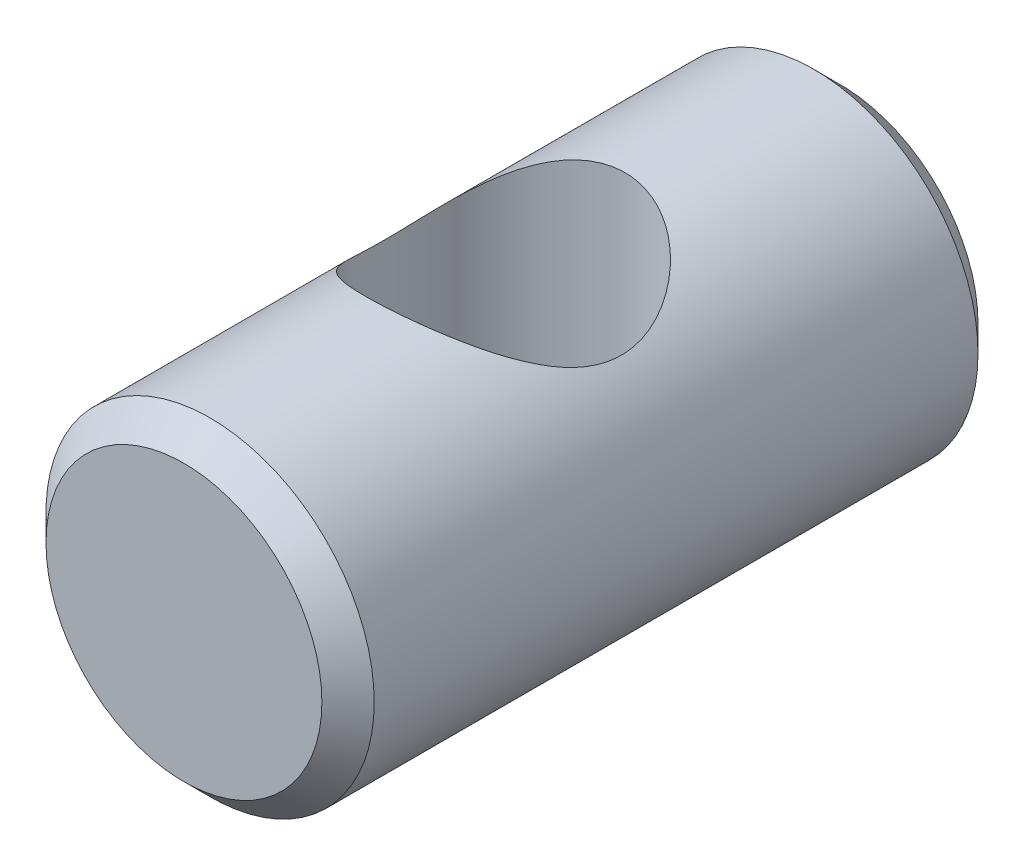
ISO-10303-21;
HEADER;
FILE_DESCRIPTION(('STEP AP214'),'2;1');
FILE_NAME('part.step','',(''),(''),'','','');
FILE_SCHEMA(('AUTOMOTIVE_DESIGN { 1 0 10303 214 1 1 1 1 }'));
ENDSEC;
DATA;
#1=APPLICATION_CONTEXT('core data for automotive mechanical design processes');
#2=APPLICATION_PROTOCOL_DEFINITION('international standard','automotive_design',2000,#1);
#3=PRODUCT_CONTEXT('',#1,'mechanical');
#4=PRODUCT('Part','Part','',(#3));
#5=PRODUCT_RELATED_PRODUCT_CATEGORY('part','',(#4));
#6=PRODUCT_DEFINITION_FORMATION('','',#4);
#7=PRODUCT_DEFINITION_CONTEXT('part definition',#1,'design');
#8=PRODUCT_DEFINITION('design','',#6,#7);
#9=PRODUCT_DEFINITION_SHAPE('','',#8);
#10=(LENGTH_UNIT() NAMED_UNIT(*) SI_UNIT(.MILLI.,.METRE.));
#11=(NAMED_UNIT(*) PLANE_ANGLE_UNIT() SI_UNIT($,.RADIAN.));
#12=(NAMED_UNIT(*) SI_UNIT($,.STERADIAN.) SOLID_ANGLE_UNIT());
#13=UNCERTAINTY_MEASURE_WITH_UNIT(LENGTH_MEASURE(1.E-05),#10,'distance_accuracy_value','');
#14=(GEOMETRIC_REPRESENTATION_CONTEXT(3) GLOBAL_UNCERTAINTY_ASSIGNED_CONTEXT((#13)) GLOBAL_UNIT_ASSIGNED_CONTEXT((#10,
#11,#12)) REPRESENTATION_CONTEXT('',''));
#15=CARTESIAN_POINT('',(0.,0.,0.));
#16=DIRECTION('',(0.,0.,1.));
#17=DIRECTION('',(1.,0.,0.));
#18=AXIS2_PLACEMENT_3D('',#15,#16,#17);
#19=CARTESIAN_POINT('',(0.,0.,9.525));
#20=DIRECTION('',(0.,0.,-1.));
#21=DIRECTION('',(-1.,0.,0.));
#22=AXIS2_PLACEMENT_3D('',#19,#20,#21);
#23=CYLINDRICAL_SURFACE('',#22,4.765);
#24=CARTESIAN_POINT('',(0.,-4.765,-3.42087708051605));
#25=CARTESIAN_POINT('',(-0.0833627581168181,-4.7649997101109,-3.42696899134863));
#26=CARTESIAN_POINT('',(-0.166953392424251,-4.76280757869707,-3.43001003086424));
#27=CARTESIAN_POINT('',(-0.333933182408652,-4.75402028790231,-3.4299899120654));
#28=CARTESIAN_POINT('',(-0.41732223719261,-4.74742325494959,-3.42692615604904));
#29=CARTESIAN_POINT('',(-0.583312250165056,-4.72989865727235,-3.41478160746824));
#30=CARTESIAN_POINT('',(-0.665912068503747,-4.71896558414041,-3.40569315136156));
#31=CARTESIAN_POINT('',(-0.829610597514772,-4.69295834085159,-3.38168739143667));
#32=CARTESIAN_POINT('',(-0.91070865358331,-4.67788240819801,-3.36676760565251));
#33=CARTESIAN_POINT('',(-1.15000632689336,-4.62699847385246,-3.31382161536754));
#34=CARTESIAN_POINT('',(-1.30524951697123,-4.58542013528299,-3.26752778272676));
#35=CARTESIAN_POINT('',(-1.60411463212557,-4.48962808746058,-3.15544383432779));
#36=CARTESIAN_POINT('',(-1.74773682156028,-4.43541466574349,-3.08965416222603));
#37=CARTESIAN_POINT('',(-2.03259497643689,-4.31273538578719,-2.93522566350036));
#38=CARTESIAN_POINT('',(-2.17272279857911,-4.24347672491827,-2.84518090003159));
#39=CARTESIAN_POINT('',(-2.43631552731587,-4.09784606286129,-2.64803347355049));
#40=CARTESIAN_POINT('',(-2.55976291960052,-4.02146672501527,-2.54091313456509));
#41=CARTESIAN_POINT('',(-2.81327393100644,-3.84950291536883,-2.28757037498761));
#42=CARTESIAN_POINT('',(-2.93940806717613,-3.75321839663728,-2.13784494064544));
#43=CARTESIAN_POINT('',(-3.10885207016274,-3.61188607024724,-1.89774924473951));
#44=CARTESIAN_POINT('',(-3.16205944901992,-3.56527135977744,-1.81509327318893));
#45=CARTESIAN_POINT('',(-3.26165283895997,-3.47438917550769,-1.64456461914389));
#46=CARTESIAN_POINT('',(-3.30804141803447,-3.43012082209569,-1.55669391813204));
#47=CARTESIAN_POINT('',(-3.41144333221737,-3.32784018306176,-1.33801732923479));
#48=CARTESIAN_POINT('',(-3.46485738281701,-3.27176419567389,-1.20454764001565));
#49=CARTESIAN_POINT('',(-3.55539465585279,-3.1731532714438,-0.92756721927326));
#50=CARTESIAN_POINT('',(-3.59255605597934,-3.13058666617785,-0.784080947165173));
#51=CARTESIAN_POINT('',(-3.64343651296181,-3.07113542283653,-0.514646140223209));
#52=CARTESIAN_POINT('',(-3.66010628533956,-3.05107413064414,-0.389980532152303));
#53=CARTESIAN_POINT('',(-3.67954153570878,-3.02761567970702,-0.13805144197163));
#54=CARTESIAN_POINT('',(-3.68232117171679,-3.02420155283186,-0.0107907379518655));
#55=CARTESIAN_POINT('',(-3.67376621747767,-3.03458366659267,0.242449329866106));
#56=CARTESIAN_POINT('',(-3.66243797397314,-3.04837216824954,0.368429244158408));
#57=CARTESIAN_POINT('',(-3.62657095184853,-3.09094772918142,0.615927376424316));
#58=CARTESIAN_POINT('',(-3.60201250089043,-3.11975712134959,0.737438661719832));
#59=CARTESIAN_POINT('',(-3.52797021750045,-3.20358122773375,1.02486117239319));
#60=CARTESIAN_POINT('',(-3.47231020523667,-3.26453704351351,1.18741075414518));
#61=CARTESIAN_POINT('',(-3.34017866781708,-3.39961296516166,1.498121783823));
#62=CARTESIAN_POINT('',(-3.2636446149314,-3.47377238661047,1.64623815847782));
#63=CARTESIAN_POINT('',(-3.12200897105521,-3.60054284241464,1.87825971607124));
#64=CARTESIAN_POINT('',(-3.06234750531042,-3.65156363596669,1.9664324955114));
#65=CARTESIAN_POINT('',(-2.93536296354977,-3.75440484501345,2.13658829521524));
#66=CARTESIAN_POINT('',(-2.86803758566651,-3.80622549668558,2.21856944344932));
#67=CARTESIAN_POINT('',(-2.65493557738645,-3.96070606463684,2.4548169203279));
#68=CARTESIAN_POINT('',(-2.4978237985218,-4.06258137631192,2.59972905493882));
#69=CARTESIAN_POINT('',(-2.18575837138569,-4.23718725327564,2.83706621766583));
#70=CARTESIAN_POINT('',(-2.03548298499758,-4.31186637762032,2.93424360521689));
#71=CARTESIAN_POINT('',(-1.71702572980925,-4.44824656330391,3.10568912436018));
#72=CARTESIAN_POINT('',(-1.54887024912961,-4.50996636079323,3.17999040299218));
#73=CARTESIAN_POINT('',(-1.22389848309853,-4.60778480850806,3.29263516387729));
#74=CARTESIAN_POINT('',(-1.06910753325384,-4.64632732736096,3.33468022800881));
#75=CARTESIAN_POINT('',(-0.752190984217971,-4.70801774696666,3.39687013419293));
#76=CARTESIAN_POINT('',(-0.590069112764688,-4.73117337991453,3.4170259792185));
#77=CARTESIAN_POINT('',(-0.262598143568304,-4.7606051003247,3.43390286080124));
#78=CARTESIAN_POINT('',(-0.0972412962651654,-4.76683385814853,3.43055828056669));
#79=CARTESIAN_POINT('',(0.231024129353291,-4.76222706928004,3.40010195996678));
#80=CARTESIAN_POINT('',(0.393932420256084,-4.75138953488968,3.37298745129903));
#81=CARTESIAN_POINT('',(0.705514268669747,-4.71498049061455,3.2979508357131));
#82=CARTESIAN_POINT('',(0.854498752183593,-4.69006694126301,3.25098003249397));
#83=CARTESIAN_POINT('',(1.14256413370517,-4.62833634686259,3.13840780618742));
#84=CARTESIAN_POINT('',(1.28164310390504,-4.59151699239254,3.07280276883643));
#85=CARTESIAN_POINT('',(1.5605913242394,-4.50478911028579,2.91796402171938));
#86=CARTESIAN_POINT('',(1.6992420339739,-4.45396042558585,2.82706121692328));
#87=CARTESIAN_POINT('',(1.96045324775841,-4.34533105232054,2.62789389216064));
#88=CARTESIAN_POINT('',(2.08299871660834,-4.28752394420402,2.51961335554432));
#89=CARTESIAN_POINT('',(2.33061071233595,-4.15886196775128,2.26753986981794));
#90=CARTESIAN_POINT('',(2.45245602746959,-4.08747815085455,2.12084350362776));
#91=CARTESIAN_POINT('',(2.67091966387116,-3.94818744226299,1.80818256348861));
#92=CARTESIAN_POINT('',(2.76753692468301,-3.88028069682256,1.64221717999394));
#93=CARTESIAN_POINT('',(2.91829752704228,-3.76775877390235,1.32363316444147));
#94=CARTESIAN_POINT('',(2.97693831230802,-3.72114907301219,1.17388770573105));
#95=CARTESIAN_POINT('',(3.04915600293589,-3.66180847873486,0.941826581338293));
#96=CARTESIAN_POINT('',(3.0706008978109,-3.64379412637323,0.863255129060434));
#97=CARTESIAN_POINT('',(3.10797188341904,-3.61197174564401,0.703992654043788));
#98=CARTESIAN_POINT('',(3.12390068817333,-3.59816164910817,0.623302694735672));
#99=CARTESIAN_POINT('',(3.15010468685879,-3.57524455910332,0.459495462666018));
#100=CARTESIAN_POINT('',(3.16032158062367,-3.5661861203942,0.376361962516616));
#101=CARTESIAN_POINT('',(3.17464168800661,-3.55344451616001,0.209195138832912));
#102=CARTESIAN_POINT('',(3.17874788699032,-3.54975872585817,0.125162274904956));
#103=CARTESIAN_POINT('',(3.18076053743013,-3.54795587812489,-0.0430393452037649));
#104=CARTESIAN_POINT('',(3.17866722999484,-3.54983860412504,-0.127208095972433));
#105=CARTESIAN_POINT('',(3.16833758034576,-3.55905933774995,-0.294840628996076));
#106=CARTESIAN_POINT('',(3.16010150131517,-3.56639711165655,-0.378304441298765));
#107=CARTESIAN_POINT('',(3.129430196119,-3.59341005189328,-0.604314657609784));
#108=CARTESIAN_POINT('',(3.10101793603989,-3.61818171011667,-0.745494317394035));
#109=CARTESIAN_POINT('',(3.02771937958645,-3.67972750014127,-1.02069983126741));
#110=CARTESIAN_POINT('',(2.98281650470617,-3.71651370639189,-1.1547183301723));
#111=CARTESIAN_POINT('',(2.8560768918245,-3.8153502491925,-1.46853642894096));
#112=CARTESIAN_POINT('',(2.76664814536404,-3.88152734494911,-1.64398166227299));
#113=CARTESIAN_POINT('',(2.56077346334119,-4.02033820070584,-1.97551522842484));
#114=CARTESIAN_POINT('',(2.44428083509274,-4.09298298410994,-2.13156938380249));
#115=CARTESIAN_POINT('',(2.18450650401399,-4.2373970566927,-2.42421216807333));
#116=CARTESIAN_POINT('',(2.04090097393914,-4.30914323590253,-2.56052605726515));
#117=CARTESIAN_POINT('',(1.72973058522059,-4.44318432752426,-2.80802181758102));
#118=CARTESIAN_POINT('',(1.56219804304704,-4.50549175797245,-2.91923707314102));
#119=CARTESIAN_POINT('',(1.23969583506405,-4.60338031575656,-3.09396462152008));
#120=CARTESIAN_POINT('',(1.08834922542924,-4.64178783933997,-3.16252149709775));
#121=CARTESIAN_POINT('',(0.85338781071092,-4.68864069192958,-3.24875451241662));
#122=CARTESIAN_POINT('',(0.773800863355168,-4.70245945854321,-3.27471971164357));
#123=CARTESIAN_POINT('',(0.612411306870997,-4.72618391319332,-3.32087000112459));
#124=CARTESIAN_POINT('',(0.530609679466058,-4.73609130567107,-3.34105760799584));
#125=CARTESIAN_POINT('',(0.374335243630177,-4.75084997254152,-3.37353939001354));
#126=CARTESIAN_POINT('',(0.300030947704158,-4.75613339853629,-3.38645258471521));
#127=CARTESIAN_POINT('',(0.150546671086999,-4.76320900575073,-3.40736829831093));
#128=CARTESIAN_POINT('',(0.0753664637160969,-4.76500026208246,-3.41536951590209));
#129=CARTESIAN_POINT('',(0.,-4.765,-3.42087708051605));
#130=B_SPLINE_CURVE_WITH_KNOTS('',3,(#24,#25,#26,#27,#28,#29,#30,#31,#32,#33,#34,#35,#36,#37,
#38,#39,#40,#41,#42,#43,#44,#45,#46,#47,#48,#49,#50,#51,#52,#53,#54,#55,#56,#57,#58,#59,#60,#61,
#62,#63,#64,#65,#66,#67,#68,#69,#70,#71,#72,#73,#74,#75,#76,#77,#78,#79,#80,#81,#82,#83,#84,#85,
#86,#87,#88,#89,#90,#91,#92,#93,#94,#95,#96,#97,#98,#99,#100,#101,#102,#103,#104,#105,#106,#107,
#108,#109,#110,#111,#112,#113,#114,#115,#116,#117,#118,#119,#120,#121,#122,#123,#124,#125,#126,
#127,#128,#129),.UNSPECIFIED.,.T.,.F.,(4,2,2,2,2,2,2,2,2,2,2,2,2,2,2,2,2,2,2,2,2,2,2,2,2,2,2,2,
2,2,2,2,2,2,2,2,2,2,2,2,2,2,2,2,2,2,2,2,2,2,2,2,4),(0.,0.250678148817341,0.501462988541287,
0.752567445437252,1.00377889552888,1.50309474088369,2.00239922444642,2.54160992918404,
3.08138247258981,3.73300244855075,4.05909733145616,4.38506908912952,4.84654436743379,
5.30692973453839,5.68734604359481,6.06737452056514,6.44723209503533,6.82765605484285,
7.37157480546313,7.91714109472133,8.27090631470675,8.62477807035776,9.33119791439566,
9.91077027397039,10.4894988486046,10.9822712500665,11.4747958366297,11.9686961727678,
12.4626540373564,12.9352342359093,13.4079061579591,13.9261848288361,14.4449439577642,
15.0533142145202,15.6617100398796,16.1619385675779,16.4119146790501,16.6617676221917,
16.9141262556176,17.1663615593023,17.4185870532858,17.6708017414467,18.1072101440206,
18.5440584873629,19.1640002904501,19.7850197135797,20.4139885307568,21.0421157411608,
21.5513660687497,21.8056438515067,22.059810706191,22.2863833912941,22.5130160751694),.UNSPECIFIED.);
#131=CARTESIAN_POINT('',(0.,-4.765,-3.42087708051605));
#132=VERTEX_POINT('',#131);
#133=EDGE_CURVE('E10',#132,#132,#130,.T.);
#134=ORIENTED_EDGE('',*,*,#133,.T.);
#135=EDGE_LOOP('',(#134));
#136=FACE_BOUND('',#135,.T.);
#137=CARTESIAN_POINT('',(-0.25,4.75843724346555,3.43));
#138=CARTESIAN_POINT('',(-0.422180009069406,4.749390618167,3.42999980483541));
#139=CARTESIAN_POINT('',(-0.59386282730199,4.73091871113112,3.41695856293195));
#140=CARTESIAN_POINT('',(-0.930629104770302,4.67635636796384,3.36610979440147));
#141=CARTESIAN_POINT('',(-1.09570851357914,4.64025529237457,3.32828730721862));
#142=CARTESIAN_POINT('',(-1.41392411864396,4.55336447971862,3.23075051942857));
#143=CARTESIAN_POINT('',(-1.56712334101048,4.5026601113221,3.17116292636266));
#144=CARTESIAN_POINT('',(-1.85998836726663,4.38979766700268,3.03299834240104));
#145=CARTESIAN_POINT('',(-1.99965414606241,4.32763956984278,2.95442131629586));
#146=CARTESIAN_POINT('',(-2.27820698899914,4.18828982189439,2.77162910883962));
#147=CARTESIAN_POINT('',(-2.41542819149111,4.11020218068904,2.66557505303866));
#148=CARTESIAN_POINT('',(-2.67111072919315,3.94883137284482,2.43572487373919));
#149=CARTESIAN_POINT('',(-2.78953546002451,3.86553849846079,2.31189500490524));
#150=CARTESIAN_POINT('',(-2.96344629098398,3.732292646302,2.10063521621267));
#151=CARTESIAN_POINT('',(-3.02522112465854,3.68226630299909,2.01833701427756));
#152=CARTESIAN_POINT('',(-3.14150590868554,3.58357003530251,1.84790207991889));
#153=CARTESIAN_POINT('',(-3.1960131207988,3.5349006275963,1.7597631654945));
#154=CARTESIAN_POINT('',(-3.29731229261899,3.44060115304685,1.57784833521895));
#155=CARTESIAN_POINT('',(-3.34411822611588,3.39496567295495,1.48408305992192));
#156=CARTESIAN_POINT('',(-3.42959137880208,3.30859742398812,1.29083456033672));
#157=CARTESIAN_POINT('',(-3.46826509160405,3.2678607546062,1.19135597958454));
#158=CARTESIAN_POINT('',(-3.54347659526858,3.18632211811376,0.966712328692861));
#159=CARTESIAN_POINT('',(-3.57812346664731,3.14705996480953,0.840323998552468));
#160=CARTESIAN_POINT('',(-3.63302442402354,3.08352956814293,0.580976208361932));
#161=CARTESIAN_POINT('',(-3.65331272726122,3.05922569654856,0.448033183521057));
#162=CARTESIAN_POINT('',(-3.67812283683354,3.02936636632518,0.177337549423231));
#163=CARTESIAN_POINT('',(-3.68251233934075,3.02396824643502,0.0395541719109347));
#164=CARTESIAN_POINT('',(-3.67470644643728,3.03344305810687,-0.234875874606968));
#165=CARTESIAN_POINT('',(-3.66249943392474,3.04833018879986,-0.37152167996018));
#166=CARTESIAN_POINT('',(-3.62015799382368,3.09852315491188,-0.655828380639309));
#167=CARTESIAN_POINT('',(-3.58799174144691,3.13612809889826,-0.802759414360211));
#168=CARTESIAN_POINT('',(-3.50660899556505,3.22685391573891,-1.08690765852793));
#169=CARTESIAN_POINT('',(-3.45734815065714,3.28001509196861,-1.22409847190397));
#170=CARTESIAN_POINT('',(-3.35999029035731,3.37921222953507,-1.45031682658415));
#171=CARTESIAN_POINT('',(-3.31552748835515,3.42299124550292,-1.54196683547208));
#172=CARTESIAN_POINT('',(-3.21937168211258,3.51357799533849,-1.7198719105116));
#173=CARTESIAN_POINT('',(-3.16767569861283,3.56038697291961,-1.80612473233373));
#174=CARTESIAN_POINT('',(-3.05733519065029,3.655577234441,-1.97327341136436));
#175=CARTESIAN_POINT('',(-2.99868376029761,3.70396004583247,-2.05416381804875));
#176=CARTESIAN_POINT('',(-2.87465956601933,3.80102084509467,-2.21043246978884));
#177=CARTESIAN_POINT('',(-2.80928649472037,3.84969884636825,-2.28581046249783));
#178=CARTESIAN_POINT('',(-2.6702557671566,3.94744940552613,-2.43263894546763));
#179=CARTESIAN_POINT('',(-2.59643405525365,3.99650228404323,-2.50394748039488));
#180=CARTESIAN_POINT('',(-2.44198609531555,4.09270177982323,-2.64020867362414));
#181=CARTESIAN_POINT('',(-2.36135999487914,4.13984843840247,-2.70516146972696));
#182=CARTESIAN_POINT('',(-2.19361254846785,4.2311207520192,-2.82808330517596));
#183=CARTESIAN_POINT('',(-2.10650409604225,4.27525208591359,-2.88606563800173));
#184=CARTESIAN_POINT('',(-1.92594548966524,4.3595756679867,-2.99452956360935));
#185=CARTESIAN_POINT('',(-1.8324951446076,4.39976779737236,-3.04501093021117));
#186=CARTESIAN_POINT('',(-1.58991791011193,4.49465680101692,-3.16160717844564));
#187=CARTESIAN_POINT('',(-1.43688887677842,4.54617300319559,-3.22239703143537));
#188=CARTESIAN_POINT('',(-1.11985321098478,4.63445714602499,-3.3220213557935));
#189=CARTESIAN_POINT('',(-0.955854490731875,4.67123558567514,-3.36087146486794));
#190=CARTESIAN_POINT('',(-0.620041304864638,4.72756501903715,-3.41423360193657));
#191=CARTESIAN_POINT('',(-0.448189976813925,4.74702354164412,-3.42861536060857));
#192=CARTESIAN_POINT('',(-0.10319553205656,4.76701209164517,-3.43119218349009));
#193=CARTESIAN_POINT('',(0.069947271391446,4.76754656888776,-3.41939340455174));
#194=CARTESIAN_POINT('',(0.396800733953032,4.75102741592386,-3.37216085402572));
#195=CARTESIAN_POINT('',(0.550903795546911,4.73547935394817,-3.33884247322146));
#196=CARTESIAN_POINT('',(0.851262679297079,4.69080460019725,-3.25216372524372));
#197=CARTESIAN_POINT('',(0.997516834516369,4.66167503663273,-3.19879911978834));
#198=CARTESIAN_POINT('',(1.28614476637547,4.59066745677348,-3.07104032256261));
#199=CARTESIAN_POINT('',(1.42797966766526,4.5482360225696,-2.99574591149817));
#200=CARTESIAN_POINT('',(1.69771873358212,4.45459184021555,-2.82781924377908));
#201=CARTESIAN_POINT('',(1.82561916137349,4.40337674596602,-2.73518235437366));
#202=CARTESIAN_POINT('',(2.08559098582612,4.28706511495821,-2.51852707855975));
#203=CARTESIAN_POINT('',(2.2150420244168,4.22105957781513,-2.39185853378127));
#204=CARTESIAN_POINT('',(2.4525288591269,4.08765163666692,-2.119882962336));
#205=CARTESIAN_POINT('',(2.56051870491994,4.02024656957631,-1.97453701758847));
#206=CARTESIAN_POINT('',(2.71141297716131,3.91890470250436,-1.73364032653499));
#207=CARTESIAN_POINT('',(2.76225962831151,3.88310759046258,-1.64375989611527));
#208=CARTESIAN_POINT('',(2.85606768069206,3.81463871939836,-1.45876664530863));
#209=CARTESIAN_POINT('',(2.8990272649147,3.78196768138303,-1.36365262576039));
#210=CARTESIAN_POINT('',(2.97638382467227,3.7213945324715,-1.16888238761678));
#211=CARTESIAN_POINT('',(3.01080676435227,3.6934780438477,-1.06924106056856));
#212=CARTESIAN_POINT('',(3.07061216797024,3.64390866973889,-0.865836413850732));
#213=CARTESIAN_POINT('',(3.09600079900905,3.62225151334222,-0.762075960014793));
#214=CARTESIAN_POINT('',(3.14431905107756,3.58048576732931,-0.51427610984992));
#215=CARTESIAN_POINT('',(3.1632690781055,3.56357947310397,-0.36886387726438));
#216=CARTESIAN_POINT('',(3.18229415057448,3.54660528363273,-0.0759553160984843));
#217=CARTESIAN_POINT('',(3.18238833621043,3.54652031339164,0.0715387471135818));
#218=CARTESIAN_POINT('',(3.16376347579515,3.56313911837427,0.36412784346974));
#219=CARTESIAN_POINT('',(3.14506985693007,3.57982020262542,0.509225849632981));
#220=CARTESIAN_POINT('',(3.09006178812863,3.6274007096972,0.793694678976364));
#221=CARTESIAN_POINT('',(3.05372153995533,3.65832094581284,0.933056792070445));
#222=CARTESIAN_POINT('',(2.94995679839854,3.74283457822027,1.249627259653));
#223=CARTESIAN_POINT('',(2.87616913174531,3.80056128592335,1.42363336901504));
#224=CARTESIAN_POINT('',(2.70309172031867,3.9255469405295,1.75476054116614));
#225=CARTESIAN_POINT('',(2.60375916203549,3.99282180458683,1.91185262262683));
#226=CARTESIAN_POINT('',(2.37965965281677,4.13038218124549,2.21024978907531));
#227=CARTESIAN_POINT('',(2.25446848393284,4.20070005001654,2.35122119961121));
#228=CARTESIAN_POINT('',(1.98132226028618,4.33621841215064,2.61183089931648));
#229=CARTESIAN_POINT('',(1.83339056066265,4.40142405331531,2.73149080683867));
#230=CARTESIAN_POINT('',(1.53413492006617,4.51378899534322,2.93439863762912));
#231=CARTESIAN_POINT('',(1.38501302638156,4.56214832085995,3.02021473285691));
#232=CARTESIAN_POINT('',(1.07249564524745,4.64554146755817,3.16951406225263));
#233=CARTESIAN_POINT('',(0.909111289256103,4.68058556855773,3.23301452201411));
#234=CARTESIAN_POINT('',(0.581478494873657,4.73212589223905,3.33183530764178));
#235=CARTESIAN_POINT('',(0.417802064196769,4.74955942472212,3.36854686433097));
#236=CARTESIAN_POINT('',(0.0859254534274418,4.76711849433294,3.41762518536938));
#237=CARTESIAN_POINT('',(-0.0822731758795955,4.76724989098796,3.43000019011695));
#238=CARTESIAN_POINT('',(-0.25,4.75843724346555,3.43));
#239=B_SPLINE_CURVE_WITH_KNOTS('',3,(#137,#138,#139,#140,#141,#142,#143,#144,#145,#146,#147,
#148,#149,#150,#151,#152,#153,#154,#155,#156,#157,#158,#159,#160,#161,#162,#163,#164,#165,#166,
#167,#168,#169,#170,#171,#172,#173,#174,#175,#176,#177,#178,#179,#180,#181,#182,#183,#184,#185,
#186,#187,#188,#189,#190,#191,#192,#193,#194,#195,#196,#197,#198,#199,#200,#201,#202,#203,#204,
#205,#206,#207,#208,#209,#210,#211,#212,#213,#214,#215,#216,#217,#218,#219,#220,#221,#222,#223,
#224,#225,#226,#227,#228,#229,#230,#231,#232,#233,#234,#235,#236,#237,#238),.UNSPECIFIED.,.T.,
.F.,(4,2,2,2,2,2,2,2,2,2,2,2,2,2,2,2,2,2,2,2,2,2,2,2,2,2,2,2,2,2,2,2,2,2,2,2,2,2,2,2,2,2,2,2,2,
2,2,2,2,2,4),(0.,0.516551025096824,1.03341418220019,1.54731512007828,2.06121701081903,
2.62982932183038,3.19953571462131,3.54246459279583,3.88552231417978,4.22795053195655,
4.57010427222594,4.97905439316964,5.38702665221778,5.79838620186915,6.21003384012951,
6.67262967068467,7.1364347778277,7.46866532411958,7.80103311718076,8.13373371721725,
8.46644953806418,8.80733809568013,9.14821926074384,9.48843965067855,9.82867029735156,
10.3440014803113,10.8589648922706,11.3766614843259,11.8942363430695,12.3673901670618,
12.8406440841658,13.3370245096255,13.8335377244494,14.4096746680997,14.9870321881218,
15.3145391492316,15.6421214663625,15.968694875667,16.2950449261748,16.7357599059526,
17.1760275223247,17.6157000871626,18.0560173690192,18.6457302885718,19.2364380888803,
19.8377403374759,20.4384291081866,20.9723943239786,21.5059464582794,22.0093081125728,
22.5124992983782),.UNSPECIFIED.);
#240=CARTESIAN_POINT('',(-0.25,4.75843724346555,3.43));
#241=VERTEX_POINT('',#240);
#242=EDGE_CURVE('E50',#241,#241,#239,.T.);
#243=ORIENTED_EDGE('',*,*,#242,.T.);
#244=EDGE_LOOP('',(#243));
#245=FACE_BOUND('',#244,.T.);
#246=CARTESIAN_POINT('',(0.,0.,-8.76499999999999));
#247=DIRECTION('',(0.,0.,1.));
#248=DIRECTION('',(1.,0.,0.));
#249=AXIS2_PLACEMENT_3D('',#246,#247,#248);
#250=CIRCLE('',#249,4.765);
#251=CARTESIAN_POINT('',(4.765,0.,-8.76499999999999));
#252=VERTEX_POINT('',#251);
#253=EDGE_CURVE('E91',#252,#252,#250,.T.);
#254=ORIENTED_EDGE('',*,*,#253,.T.);
#255=EDGE_LOOP('',(#254));
#256=FACE_BOUND('',#255,.T.);
#257=CARTESIAN_POINT('',(0.,0.,8.76500000000001));
#258=DIRECTION('',(0.,0.,1.));
#259=DIRECTION('',(1.,0.,0.));
#260=AXIS2_PLACEMENT_3D('',#257,#258,#259);
#261=CIRCLE('',#260,4.765);
#262=CARTESIAN_POINT('',(4.765,0.,8.76500000000001));
#263=VERTEX_POINT('',#262);
#264=EDGE_CURVE('E94',#263,#263,#261,.F.);
#265=ORIENTED_EDGE('',*,*,#264,.T.);
#266=EDGE_LOOP('',(#265));
#267=FACE_BOUND('',#266,.T.);
#268=ADVANCED_FACE('F37',(#136,#245,#256,#267),#23,.T.);
#269=CARTESIAN_POINT('',(0.,0.,9.525));
#270=DIRECTION('',(0.,0.,1.));
#271=DIRECTION('',(1.,0.,0.));
#272=AXIS2_PLACEMENT_3D('',#269,#270,#271);
#273=PLANE('',#272);
#274=CARTESIAN_POINT('',(0.,0.,9.525));
#275=DIRECTION('',(0.,0.,1.));
#276=DIRECTION('',(1.,0.,0.));
#277=AXIS2_PLACEMENT_3D('',#274,#275,#276);
#278=CIRCLE('',#277,4.00500000000001);
#279=CARTESIAN_POINT('',(4.00500000000001,0.,9.525));
#280=VERTEX_POINT('',#279);
#281=EDGE_CURVE('E54',#280,#280,#278,.T.);
#282=ORIENTED_EDGE('',*,*,#281,.T.);
#283=EDGE_LOOP('',(#282));
#284=FACE_BOUND('',#283,.T.);
#285=ADVANCED_FACE('F71',(#284),#273,.T.);
#286=CARTESIAN_POINT('',(0.,0.,-9.525));
#287=DIRECTION('',(0.,0.,1.));
#288=DIRECTION('',(1.,0.,0.));
#289=AXIS2_PLACEMENT_3D('',#286,#287,#288);
#290=PLANE('',#289);
#291=CARTESIAN_POINT('',(0.,0.,-9.525));
#292=DIRECTION('',(0.,0.,1.));
#293=DIRECTION('',(1.,0.,0.));
#294=AXIS2_PLACEMENT_3D('',#291,#292,#293);
#295=CIRCLE('',#294,4.00499999999998);
#296=CARTESIAN_POINT('',(4.00499999999998,0.,-9.525));
#297=VERTEX_POINT('',#296);
#298=EDGE_CURVE('E58',#297,#297,#295,.F.);
#299=ORIENTED_EDGE('',*,*,#298,.T.);
#300=EDGE_LOOP('',(#299));
#301=FACE_BOUND('',#300,.T.);
#302=ADVANCED_FACE('F74',(#301),#290,.F.);
#303=CARTESIAN_POINT('',(0.,0.,-8.76499999999999));
#304=DIRECTION('',(0.,0.,1.));
#305=DIRECTION('',(1.,0.,0.));
#306=AXIS2_PLACEMENT_3D('',#303,#304,#305);
#307=CONICAL_SURFACE('',#306,4.765,0.785398163397451);
#308=ORIENTED_EDGE('',*,*,#298,.F.);
#309=EDGE_LOOP('',(#308));
#310=FACE_BOUND('',#309,.T.);
#311=ORIENTED_EDGE('',*,*,#253,.F.);
#312=EDGE_LOOP('',(#311));
#313=FACE_BOUND('',#312,.T.);
#314=ADVANCED_FACE('F77',(#310,#313),#307,.T.);
#315=CARTESIAN_POINT('',(0.,0.,9.525));
#316=DIRECTION('',(0.,0.,-1.));
#317=DIRECTION('',(-1.,0.,0.));
#318=AXIS2_PLACEMENT_3D('',#315,#316,#317);
#319=CONICAL_SURFACE('',#318,4.00500000000001,0.785398163397448);
#320=ORIENTED_EDGE('',*,*,#264,.F.);
#321=EDGE_LOOP('',(#320));
#322=FACE_BOUND('',#321,.T.);
#323=ORIENTED_EDGE('',*,*,#281,.F.);
#324=EDGE_LOOP('',(#323));
#325=FACE_BOUND('',#324,.T.);
#326=ADVANCED_FACE('F40',(#322,#325),#319,.T.);
#327=CARTESIAN_POINT('',(-0.25,-4.765,0.));
#328=DIRECTION('',(0.,1.,0.));
#329=DIRECTION('',(0.,0.,1.));
#330=AXIS2_PLACEMENT_3D('',#327,#328,#329);
#331=CYLINDRICAL_SURFACE('',#330,3.43);
#332=ORIENTED_EDGE('',*,*,#242,.F.);
#333=EDGE_LOOP('',(#332));
#334=FACE_BOUND('',#333,.T.);
#335=ORIENTED_EDGE('',*,*,#133,.F.);
#336=EDGE_LOOP('',(#335));
#337=FACE_BOUND('',#336,.T.);
#338=ADVANCED_FACE('F66',(#334,#337),#331,.F.);
#339=CLOSED_SHELL('',(#268,#285,#302,#314,#326,#338));
#340=MANIFOLD_SOLID_BREP('B2',#339);
#341=ADVANCED_BREP_SHAPE_REPRESENTATION('',(#18,#340),#14);
#342=SHAPE_DEFINITION_REPRESENTATION(#9,#341);
ENDSEC;
END-ISO-10303-21;
